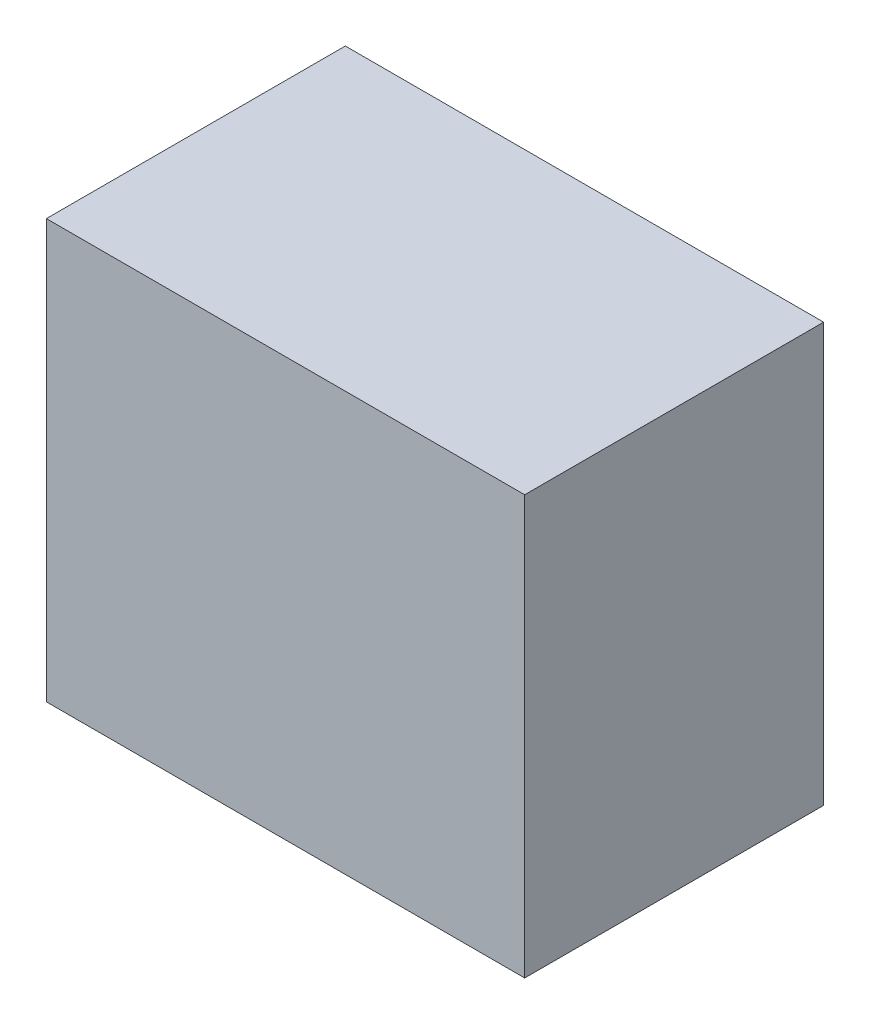
ISO-10303-21;
HEADER;
FILE_DESCRIPTION(('STEP AP214'),'2;1');
FILE_NAME('part.step','',(''),(''),'','','');
FILE_SCHEMA(('AUTOMOTIVE_DESIGN { 1 0 10303 214 1 1 1 1 }'));
ENDSEC;
DATA;
#1=APPLICATION_CONTEXT('core data for automotive mechanical design processes');
#2=APPLICATION_PROTOCOL_DEFINITION('international standard','automotive_design',2000,#1);
#3=PRODUCT_CONTEXT('',#1,'mechanical');
#4=PRODUCT('Part','Part','',(#3));
#5=PRODUCT_RELATED_PRODUCT_CATEGORY('part','',(#4));
#6=PRODUCT_DEFINITION_FORMATION('','',#4);
#7=PRODUCT_DEFINITION_CONTEXT('part definition',#1,'design');
#8=PRODUCT_DEFINITION('design','',#6,#7);
#9=PRODUCT_DEFINITION_SHAPE('','',#8);
#10=(LENGTH_UNIT() NAMED_UNIT(*) SI_UNIT(.MILLI.,.METRE.));
#11=(NAMED_UNIT(*) PLANE_ANGLE_UNIT() SI_UNIT($,.RADIAN.));
#12=(NAMED_UNIT(*) SI_UNIT($,.STERADIAN.) SOLID_ANGLE_UNIT());
#13=UNCERTAINTY_MEASURE_WITH_UNIT(LENGTH_MEASURE(1.E-05),#10,'distance_accuracy_value','');
#14=(GEOMETRIC_REPRESENTATION_CONTEXT(3) GLOBAL_UNCERTAINTY_ASSIGNED_CONTEXT((#13)) GLOBAL_UNIT_ASSIGNED_CONTEXT((#10,
#11,#12)) REPRESENTATION_CONTEXT('',''));
#15=CARTESIAN_POINT('',(0.,0.,0.));
#16=DIRECTION('',(0.,0.,1.));
#17=DIRECTION('',(1.,0.,0.));
#18=AXIS2_PLACEMENT_3D('',#15,#16,#17);
#19=CARTESIAN_POINT('',(0.,0.,31.75));
#20=DIRECTION('',(1.,0.,0.));
#21=DIRECTION('',(0.,0.,-1.));
#22=AXIS2_PLACEMENT_3D('',#19,#20,#21);
#23=PLANE('',#22);
#24=DIRECTION('',(0.,-1.,0.));
#25=VECTOR('',#24,1.);
#26=CARTESIAN_POINT('',(0.,0.,0.));
#27=LINE('',#26,#25);
#28=CARTESIAN_POINT('',(0.,44.45,0.));
#29=VERTEX_POINT('',#28);
#30=CARTESIAN_POINT('',(0.,0.,0.));
#31=VERTEX_POINT('',#30);
#32=EDGE_CURVE('E97',#29,#31,#27,.T.);
#33=ORIENTED_EDGE('',*,*,#32,.T.);
#34=DIRECTION('',(0.,0.,-1.));
#35=VECTOR('',#34,1.);
#36=CARTESIAN_POINT('',(0.,0.,31.75));
#37=LINE('',#36,#35);
#38=CARTESIAN_POINT('',(0.,0.,31.75));
#39=VERTEX_POINT('',#38);
#40=EDGE_CURVE('E11',#39,#31,#37,.T.);
#41=ORIENTED_EDGE('',*,*,#40,.F.);
#42=DIRECTION('',(0.,-1.,0.));
#43=VECTOR('',#42,1.);
#44=CARTESIAN_POINT('',(0.,0.,31.75));
#45=LINE('',#44,#43);
#46=CARTESIAN_POINT('',(0.,44.45,31.75));
#47=VERTEX_POINT('',#46);
#48=EDGE_CURVE('E85',#47,#39,#45,.T.);
#49=ORIENTED_EDGE('',*,*,#48,.F.);
#50=DIRECTION('',(0.,0.,-1.));
#51=VECTOR('',#50,1.);
#52=CARTESIAN_POINT('',(0.,44.45,31.75));
#53=LINE('',#52,#51);
#54=EDGE_CURVE('E93',#47,#29,#53,.T.);
#55=ORIENTED_EDGE('',*,*,#54,.T.);
#56=EDGE_LOOP('',(#33,#41,#49,#55));
#57=FACE_BOUND('',#56,.T.);
#58=ADVANCED_FACE('F34',(#57),#23,.F.);
#59=CARTESIAN_POINT('',(0.,0.,31.75));
#60=DIRECTION('',(0.,1.,0.));
#61=DIRECTION('',(0.,0.,1.));
#62=AXIS2_PLACEMENT_3D('',#59,#60,#61);
#63=PLANE('',#62);
#64=DIRECTION('',(1.,0.,0.));
#65=VECTOR('',#64,1.);
#66=CARTESIAN_POINT('',(0.,0.,0.));
#67=LINE('',#66,#65);
#68=CARTESIAN_POINT('',(50.8,0.,0.));
#69=VERTEX_POINT('',#68);
#70=EDGE_CURVE('E89',#31,#69,#67,.T.);
#71=ORIENTED_EDGE('',*,*,#70,.T.);
#72=DIRECTION('',(0.,0.,-1.));
#73=VECTOR('',#72,1.);
#74=CARTESIAN_POINT('',(50.8,0.,31.75));
#75=LINE('',#74,#73);
#76=CARTESIAN_POINT('',(50.8,0.,31.75));
#77=VERTEX_POINT('',#76);
#78=EDGE_CURVE('E42',#77,#69,#75,.T.);
#79=ORIENTED_EDGE('',*,*,#78,.F.);
#80=DIRECTION('',(1.,0.,0.));
#81=VECTOR('',#80,1.);
#82=CARTESIAN_POINT('',(0.,0.,31.75));
#83=LINE('',#82,#81);
#84=EDGE_CURVE('E80',#39,#77,#83,.T.);
#85=ORIENTED_EDGE('',*,*,#84,.F.);
#86=ORIENTED_EDGE('',*,*,#40,.T.);
#87=EDGE_LOOP('',(#71,#79,#85,#86));
#88=FACE_BOUND('',#87,.T.);
#89=ADVANCED_FACE('F88',(#88),#63,.F.);
#90=CARTESIAN_POINT('',(50.8,0.,31.75));
#91=DIRECTION('',(-1.,0.,0.));
#92=DIRECTION('',(0.,0.,1.));
#93=AXIS2_PLACEMENT_3D('',#90,#91,#92);
#94=PLANE('',#93);
#95=DIRECTION('',(0.,1.,0.));
#96=VECTOR('',#95,1.);
#97=CARTESIAN_POINT('',(50.8,0.,0.));
#98=LINE('',#97,#96);
#99=CARTESIAN_POINT('',(50.8,44.45,0.));
#100=VERTEX_POINT('',#99);
#101=EDGE_CURVE('E67',#69,#100,#98,.T.);
#102=ORIENTED_EDGE('',*,*,#101,.T.);
#103=DIRECTION('',(0.,0.,-1.));
#104=VECTOR('',#103,1.);
#105=CARTESIAN_POINT('',(50.8,44.45,31.75));
#106=LINE('',#105,#104);
#107=CARTESIAN_POINT('',(50.8,44.45,31.75));
#108=VERTEX_POINT('',#107);
#109=EDGE_CURVE('E90',#108,#100,#106,.T.);
#110=ORIENTED_EDGE('',*,*,#109,.F.);
#111=DIRECTION('',(0.,1.,0.));
#112=VECTOR('',#111,1.);
#113=CARTESIAN_POINT('',(50.8,0.,31.75));
#114=LINE('',#113,#112);
#115=EDGE_CURVE('E83',#77,#108,#114,.T.);
#116=ORIENTED_EDGE('',*,*,#115,.F.);
#117=ORIENTED_EDGE('',*,*,#78,.T.);
#118=EDGE_LOOP('',(#102,#110,#116,#117));
#119=FACE_BOUND('',#118,.T.);
#120=ADVANCED_FACE('F91',(#119),#94,.F.);
#121=CARTESIAN_POINT('',(0.,44.45,31.75));
#122=DIRECTION('',(0.,-1.,0.));
#123=DIRECTION('',(0.,0.,-1.));
#124=AXIS2_PLACEMENT_3D('',#121,#122,#123);
#125=PLANE('',#124);
#126=DIRECTION('',(-1.,0.,0.));
#127=VECTOR('',#126,1.);
#128=CARTESIAN_POINT('',(0.,44.45,0.));
#129=LINE('',#128,#127);
#130=EDGE_CURVE('E73',#100,#29,#129,.T.);
#131=ORIENTED_EDGE('',*,*,#130,.T.);
#132=ORIENTED_EDGE('',*,*,#54,.F.);
#133=DIRECTION('',(-1.,0.,0.));
#134=VECTOR('',#133,1.);
#135=CARTESIAN_POINT('',(0.,44.45,31.75));
#136=LINE('',#135,#134);
#137=EDGE_CURVE('E50',#108,#47,#136,.T.);
#138=ORIENTED_EDGE('',*,*,#137,.F.);
#139=ORIENTED_EDGE('',*,*,#109,.T.);
#140=EDGE_LOOP('',(#131,#132,#138,#139));
#141=FACE_BOUND('',#140,.T.);
#142=ADVANCED_FACE('F104',(#141),#125,.F.);
#143=CARTESIAN_POINT('',(0.,0.,31.75));
#144=DIRECTION('',(0.,0.,-1.));
#145=DIRECTION('',(-1.,0.,0.));
#146=AXIS2_PLACEMENT_3D('',#143,#144,#145);
#147=PLANE('',#146);
#148=ORIENTED_EDGE('',*,*,#48,.T.);
#149=ORIENTED_EDGE('',*,*,#84,.T.);
#150=ORIENTED_EDGE('',*,*,#115,.T.);
#151=ORIENTED_EDGE('',*,*,#137,.T.);
#152=EDGE_LOOP('',(#148,#149,#150,#151));
#153=FACE_BOUND('',#152,.T.);
#154=ADVANCED_FACE('F81',(#153),#147,.F.);
#155=CARTESIAN_POINT('',(0.,0.,0.));
#156=DIRECTION('',(0.,0.,-1.));
#157=DIRECTION('',(-1.,0.,0.));
#158=AXIS2_PLACEMENT_3D('',#155,#156,#157);
#159=PLANE('',#158);
#160=ORIENTED_EDGE('',*,*,#32,.F.);
#161=ORIENTED_EDGE('',*,*,#130,.F.);
#162=ORIENTED_EDGE('',*,*,#101,.F.);
#163=ORIENTED_EDGE('',*,*,#70,.F.);
#164=EDGE_LOOP('',(#160,#161,#162,#163));
#165=FACE_BOUND('',#164,.T.);
#166=ADVANCED_FACE('F107',(#165),#159,.T.);
#167=CLOSED_SHELL('',(#58,#89,#120,#142,#154,#166));
#168=MANIFOLD_SOLID_BREP('B2',#167);
#169=ADVANCED_BREP_SHAPE_REPRESENTATION('',(#18,#168),#14);
#170=SHAPE_DEFINITION_REPRESENTATION(#9,#169);
ENDSEC;
END-ISO-10303-21;
